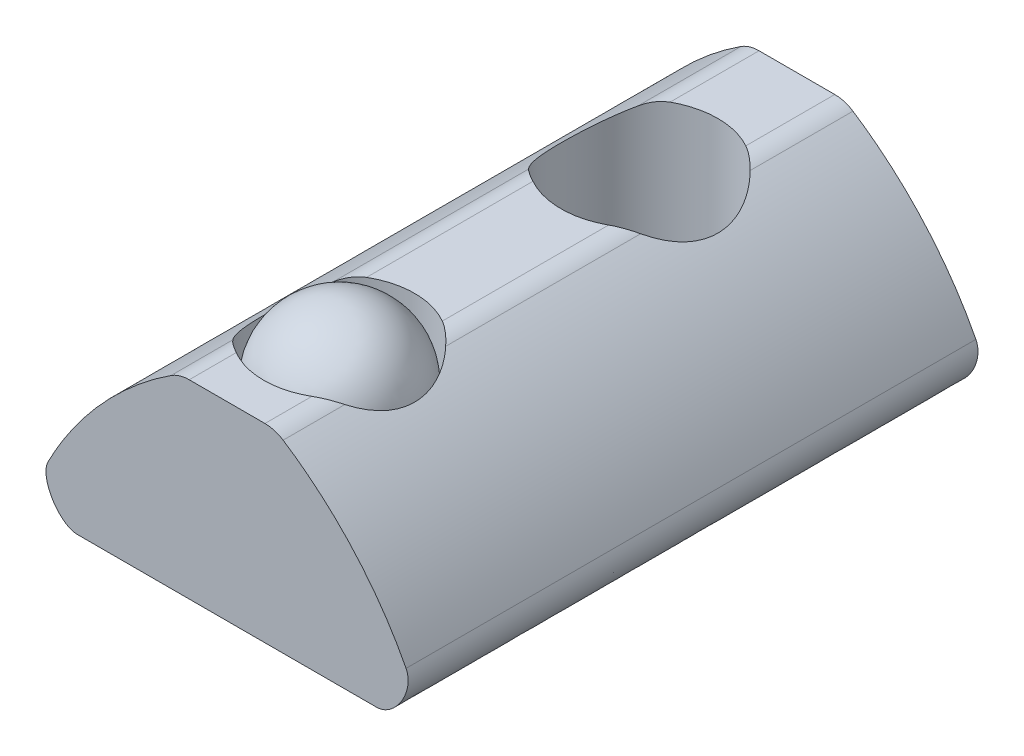
ISO-10303-21;
HEADER;
FILE_DESCRIPTION(('STEP AP214'),'2;1');
FILE_NAME('part.step','',(''),(''),'','','');
FILE_SCHEMA(('AUTOMOTIVE_DESIGN { 1 0 10303 214 1 1 1 1 }'));
ENDSEC;
DATA;
#1=APPLICATION_CONTEXT('core data for automotive mechanical design processes');
#2=APPLICATION_PROTOCOL_DEFINITION('international standard','automotive_design',2000,#1);
#3=PRODUCT_CONTEXT('',#1,'mechanical');
#4=PRODUCT('Part','Part','',(#3));
#5=PRODUCT_RELATED_PRODUCT_CATEGORY('part','',(#4));
#6=PRODUCT_DEFINITION_FORMATION('','',#4);
#7=PRODUCT_DEFINITION_CONTEXT('part definition',#1,'design');
#8=PRODUCT_DEFINITION('design','',#6,#7);
#9=PRODUCT_DEFINITION_SHAPE('','',#8);
#10=(LENGTH_UNIT() NAMED_UNIT(*) SI_UNIT(.MILLI.,.METRE.));
#11=(NAMED_UNIT(*) PLANE_ANGLE_UNIT() SI_UNIT($,.RADIAN.));
#12=(NAMED_UNIT(*) SI_UNIT($,.STERADIAN.) SOLID_ANGLE_UNIT());
#13=UNCERTAINTY_MEASURE_WITH_UNIT(LENGTH_MEASURE(1.E-05),#10,'distance_accuracy_value','');
#14=(GEOMETRIC_REPRESENTATION_CONTEXT(3) GLOBAL_UNCERTAINTY_ASSIGNED_CONTEXT((#13)) GLOBAL_UNIT_ASSIGNED_CONTEXT((#10,
#11,#12)) REPRESENTATION_CONTEXT('',''));
#15=CARTESIAN_POINT('',(0.,0.,0.));
#16=DIRECTION('',(0.,0.,1.));
#17=DIRECTION('',(1.,0.,0.));
#18=AXIS2_PLACEMENT_3D('',#15,#16,#17);
#19=CARTESIAN_POINT('',(-21.5808757413545,41.3139529714525,-20.5938046485981));
#20=DIRECTION('',(0.,1.,0.));
#21=DIRECTION('',(0.,0.,1.));
#22=AXIS2_PLACEMENT_3D('',#19,#20,#21);
#23=PLANE('',#22);
#24=CARTESIAN_POINT('',(-22.5864215322198,41.3139529714525,-17.276012221837));
#25=DIRECTION('',(0.,1.,0.));
#26=DIRECTION('',(0.,0.,1.));
#27=AXIS2_PLACEMENT_3D('',#24,#25,#26);
#28=CIRCLE('',#27,1.64999999999999);
#29=CARTESIAN_POINT('',(-21.7889618418163,41.3139529714525,-18.7205045347904));
#30=VERTEX_POINT('',#29);
#31=CARTESIAN_POINT('',(-23.3838812226233,41.3139529714525,-18.7205045347904));
#32=VERTEX_POINT('',#31);
#33=EDGE_CURVE('P0_E287',#30,#32,#28,.T.);
#34=ORIENTED_EDGE('',*,*,#33,.F.);
#35=DIRECTION('',(0.,0.,1.));
#36=VECTOR('',#35,1.);
#37=CARTESIAN_POINT('',(-21.7889618418163,41.3139529714525,-20.5938046485981));
#38=LINE('',#37,#36);
#39=CARTESIAN_POINT('',(-21.7889618418163,41.3139529714525,-20.5938046485981));
#40=VERTEX_POINT('',#39);
#41=EDGE_CURVE('P0_E188',#30,#40,#38,.F.);
#42=ORIENTED_EDGE('',*,*,#41,.T.);
#43=DIRECTION('',(-1.,0.,0.));
#44=VECTOR('',#43,1.);
#45=CARTESIAN_POINT('',(-21.5808757413545,41.3139529714525,-20.5938046485981));
#46=LINE('',#45,#44);
#47=CARTESIAN_POINT('',(-23.3838812226233,41.3139529714525,-20.5938046485981));
#48=VERTEX_POINT('',#47);
#49=EDGE_CURVE('P0_E199',#40,#48,#46,.T.);
#50=ORIENTED_EDGE('',*,*,#49,.T.);
#51=DIRECTION('',(0.,0.,1.));
#52=VECTOR('',#51,1.);
#53=CARTESIAN_POINT('',(-23.3838812226233,41.3139529714525,-20.5938046485981));
#54=LINE('',#53,#52);
#55=EDGE_CURVE('P0_E185',#48,#32,#54,.T.);
#56=ORIENTED_EDGE('',*,*,#55,.T.);
#57=EDGE_LOOP('',(#34,#42,#50,#56));
#58=FACE_BOUND('',#57,.T.);
#59=ADVANCED_FACE('P0_F34',(#58),#23,.T.);
#60=CARTESIAN_POINT('',(-23.3838812226233,40.6114210793827,-16.3891376306881));
#61=DIRECTION('',(0.,0.,1.));
#62=DIRECTION('',(1.,0.,0.));
#63=AXIS2_PLACEMENT_3D('',#60,#61,#62);
#64=CYLINDRICAL_SURFACE('',#63,0.702531892069805);
#65=CARTESIAN_POINT('',(-23.7664840677758,41.2006291260491,-16.1227765944923));
#66=CARTESIAN_POINT('',(-23.7472874967925,41.2130831298502,-16.1031363993219));
#67=CARTESIAN_POINT('',(-23.7273500697137,41.2247058447486,-16.0837154530842));
#68=CARTESIAN_POINT('',(-23.6859393424675,41.2461343895727,-16.0454181171039));
#69=CARTESIAN_POINT('',(-23.6644627952196,41.2559362116657,-16.0265430040239));
#70=CARTESIAN_POINT('',(-23.5989247036089,41.2818460594888,-15.9719822878211));
#71=CARTESIAN_POINT('',(-23.5527573231165,41.2951209366819,-15.9373273328388));
#72=CARTESIAN_POINT('',(-23.4850173192392,41.3069122033057,-15.891970456651));
#73=CARTESIAN_POINT('',(-23.4653380931175,41.3095035782089,-15.8793896751466));
#74=CARTESIAN_POINT('',(-23.4251604405094,41.3130314456689,-15.8548945873689));
#75=CARTESIAN_POINT('',(-23.4046558899514,41.3139515268956,-15.8429879911708));
#76=CARTESIAN_POINT('',(-23.3838812226233,41.3139529714525,-15.8315199088835));
#77=B_SPLINE_CURVE_WITH_KNOTS('',3,(#65,#66,#67,#68,#69,#70,#71,#72,#73,#74,#75,#76),
.UNSPECIFIED.,.F.,.F.,(4,2,2,2,2,4),(0.,0.0904080756638125,0.181012843362226,0.357529323713905,
0.427964299537039,0.499087250594516),.UNSPECIFIED.);
#78=CARTESIAN_POINT('',(-23.7664840677758,41.2006291260491,-16.1227765944923));
#79=VERTEX_POINT('',#78);
#80=CARTESIAN_POINT('',(-23.3838812226233,41.3139529714525,-15.8315199088835));
#81=VERTEX_POINT('',#80);
#82=EDGE_CURVE('P0_E154',#79,#81,#77,.T.);
#83=ORIENTED_EDGE('',*,*,#82,.F.);
#84=DIRECTION('',(0.,0.,1.));
#85=VECTOR('',#84,1.);
#86=CARTESIAN_POINT('',(-23.7664840677758,41.2006291260491,-12.0178938465854));
#87=LINE('',#86,#85);
#88=CARTESIAN_POINT('',(-23.7664840677758,41.2006291260491,-12.0178938465854));
#89=VERTEX_POINT('',#88);
#90=EDGE_CURVE('P0_E164',#89,#79,#87,.F.);
#91=ORIENTED_EDGE('',*,*,#90,.F.);
#92=CARTESIAN_POINT('',(-23.3838812226233,41.3139529714525,-12.3286715042694));
#93=CARTESIAN_POINT('',(-23.4102024315361,41.3139503408338,-12.3133860748611));
#94=CARTESIAN_POINT('',(-23.4360369470097,41.3124745623077,-12.2973581881628));
#95=CARTESIAN_POINT('',(-23.486511688802,41.306879491925,-12.2640199859217));
#96=CARTESIAN_POINT('',(-23.5111537907535,41.3027645071456,-12.2467118004143));
#97=CARTESIAN_POINT('',(-23.5820594565487,41.2871321944218,-12.1938573636354));
#98=CARTESIAN_POINT('',(-23.6264432141817,41.2722995863262,-12.1567107753813));
#99=CARTESIAN_POINT('',(-23.6852565322119,41.2463129062863,-12.1019929796837));
#100=CARTESIAN_POINT('',(-23.7021413141841,41.238007125472,-12.0855505264845));
#101=CARTESIAN_POINT('',(-23.7350232537999,41.2201912687641,-12.0520987106995));
#102=CARTESIAN_POINT('',(-23.7510111495365,41.2106711106762,-12.0350855993562));
#103=CARTESIAN_POINT('',(-23.7664840677758,41.2006291260492,-12.0178938465854));
#104=B_SPLINE_CURVE_WITH_KNOTS('',3,(#92,#93,#94,#95,#96,#97,#98,#99,#100,#101,#102,#103),
.UNSPECIFIED.,.F.,.F.,(4,2,2,2,2,4),(0.,0.0911854837038478,0.182222533754024,0.360393090692322,
0.435328148294481,0.510931679347607),.UNSPECIFIED.);
#105=CARTESIAN_POINT('',(-23.3838812226233,41.3139529714525,-12.3286715042694));
#106=VERTEX_POINT('',#105);
#107=EDGE_CURVE('P0_E237',#106,#89,#104,.T.);
#108=ORIENTED_EDGE('',*,*,#107,.F.);
#109=EDGE_CURVE('P0_E165',#81,#106,#54,.T.);
#110=ORIENTED_EDGE('',*,*,#109,.F.);
#111=EDGE_LOOP('',(#83,#91,#108,#110));
#112=FACE_BOUND('',#111,.T.);
#113=ADVANCED_FACE('P0_F162',(#112),#64,.T.);
#114=CARTESIAN_POINT('',(-21.7889618418163,40.6114210793827,-16.389118354654));
#115=DIRECTION('',(0.,0.,1.));
#116=DIRECTION('',(1.,0.,0.));
#117=AXIS2_PLACEMENT_3D('',#114,#115,#116);
#118=CYLINDRICAL_SURFACE('',#117,0.702531892069805);
#119=CARTESIAN_POINT('',(-21.7889618418163,41.3139529714525,-15.8315199088835));
#120=CARTESIAN_POINT('',(-21.7622805353445,41.3139502865238,-15.8462437864873));
#121=CARTESIAN_POINT('',(-21.7360553597341,41.3124337327941,-15.8616931379566));
#122=CARTESIAN_POINT('',(-21.684746530589,41.3066594710864,-15.8938421253453));
#123=CARTESIAN_POINT('',(-21.6596612055338,41.3024059254038,-15.9105398288057));
#124=CARTESIAN_POINT('',(-21.5874244052158,41.286204453226,-15.9615096013843));
#125=CARTESIAN_POINT('',(-21.5420926708544,41.2707879749391,-15.9973284495245));
#126=CARTESIAN_POINT('',(-21.4833514751849,41.2442539275675,-16.0487325013888));
#127=CARTESIAN_POINT('',(-21.4674193495144,41.2363012135839,-16.0632498776115));
#128=CARTESIAN_POINT('',(-21.4362938333725,41.2192795352941,-16.0927258259393));
#129=CARTESIAN_POINT('',(-21.4211078498032,41.2102016802373,-16.1076870948055));
#130=CARTESIAN_POINT('',(-21.4063561005426,41.20062724544,-16.1227795579914));
#131=B_SPLINE_CURVE_WITH_KNOTS('',3,(#119,#120,#121,#122,#123,#124,#125,#126,#127,#128,#129,
#130),.UNSPECIFIED.,.F.,.F.,(4,2,2,2,2,4),(0.,0.0912923386917037,0.182446171133288,
0.360702919821942,0.429602237236524,0.499085598375937),.UNSPECIFIED.);
#132=CARTESIAN_POINT('',(-21.7889618418163,41.3139529714525,-15.8315199088835));
#133=VERTEX_POINT('',#132);
#134=CARTESIAN_POINT('',(-21.4063561005426,41.2006272454397,-16.1227795579913));
#135=VERTEX_POINT('',#134);
#136=EDGE_CURVE('P0_E286',#133,#135,#131,.T.);
#137=ORIENTED_EDGE('',*,*,#136,.F.);
#138=CARTESIAN_POINT('',(-21.7889618418163,41.3139529714525,-12.3286715010079));
#139=VERTEX_POINT('',#138);
#140=EDGE_CURVE('P0_E189',#139,#133,#38,.F.);
#141=ORIENTED_EDGE('',*,*,#140,.F.);
#142=CARTESIAN_POINT('',(-21.4063561005426,41.2006272454397,-12.017890621919));
#143=CARTESIAN_POINT('',(-21.4248257692933,41.212610940333,-12.0384121752666));
#144=CARTESIAN_POINT('',(-21.4440332765686,41.2238574764844,-12.0586821204358));
#145=CARTESIAN_POINT('',(-21.4839868187082,41.244709203805,-12.0986322413205));
#146=CARTESIAN_POINT('',(-21.5047360171248,41.2543108784525,-12.1183110810936));
#147=CARTESIAN_POINT('',(-21.5681908971989,41.2798904365432,-12.1752343887952));
#148=CARTESIAN_POINT('',(-21.6130311064621,41.2932615794755,-12.211408343338));
#149=CARTESIAN_POINT('',(-21.6807712002384,41.3058860565277,-12.2600737453666));
#150=CARTESIAN_POINT('',(-21.7017320195924,41.3088468102311,-12.2743854659872));
#151=CARTESIAN_POINT('',(-21.7446622421523,41.3128892995619,-12.302206272617));
#152=CARTESIAN_POINT('',(-21.7666398072953,41.3139513764214,-12.3157055783771));
#153=CARTESIAN_POINT('',(-21.7889618418163,41.3139529714525,-12.3286715010079));
#154=B_SPLINE_CURVE_WITH_KNOTS('',3,(#142,#143,#144,#145,#146,#147,#148,#149,#150,#151,#152,
#153),.UNSPECIFIED.,.F.,.F.,(4,2,2,2,2,4),(0.,0.0902416489132471,0.180673879395116,
0.357006268703466,0.433580685959851,0.510943455610445),.UNSPECIFIED.);
#155=CARTESIAN_POINT('',(-21.4063561005426,41.2006272454397,-12.017890621919));
#156=VERTEX_POINT('',#155);
#157=EDGE_CURVE('P0_E242',#156,#139,#154,.T.);
#158=ORIENTED_EDGE('',*,*,#157,.F.);
#159=DIRECTION('',(0.,0.,1.));
#160=VECTOR('',#159,1.);
#161=CARTESIAN_POINT('',(-21.4063561005426,41.2006272454397,-20.5938046485981));
#162=LINE('',#161,#160);
#163=EDGE_CURVE('P0_E216',#135,#156,#162,.T.);
#164=ORIENTED_EDGE('',*,*,#163,.F.);
#165=EDGE_LOOP('',(#137,#141,#158,#164));
#166=FACE_BOUND('',#165,.T.);
#167=ADVANCED_FACE('P0_F277',(#166),#118,.T.);
#168=EDGE_CURVE('P0_E166',#81,#133,#28,.T.);
#169=ORIENTED_EDGE('',*,*,#168,.F.);
#170=ORIENTED_EDGE('',*,*,#109,.T.);
#171=CARTESIAN_POINT('',(-22.5864215350269,41.3139529714525,-10.9560046485981));
#172=DIRECTION('',(0.,1.,0.));
#173=DIRECTION('',(0.,0.,1.));
#174=AXIS2_PLACEMENT_3D('',#171,#172,#173);
#175=CIRCLE('',#174,1.58750000000004);
#176=EDGE_CURVE('P0_E298',#139,#106,#175,.T.);
#177=ORIENTED_EDGE('',*,*,#176,.F.);
#178=ORIENTED_EDGE('',*,*,#140,.T.);
#179=EDGE_LOOP('',(#169,#170,#177,#178));
#180=FACE_BOUND('',#179,.T.);
#181=ADVANCED_FACE('P0_F303',(#180),#23,.T.);
#182=CARTESIAN_POINT('',(-18.8175588370269,38.3334356724525,-20.5938046485981));
#183=CARTESIAN_POINT('',(-19.4052347819,39.4791271937958,-20.5938046485981));
#184=CARTESIAN_POINT('',(-20.3263478267443,40.4993152260092,-20.5938046485981));
#185=CARTESIAN_POINT('',(-21.4062809648588,41.2005784554818,-20.5938046485981));
#186=CARTESIAN_POINT('',(-21.4644792236907,41.2383699608054,-20.5938046485981));
#187=CARTESIAN_POINT('',(-21.5226774825226,41.276161466129,-20.5938046485981));
#188=CARTESIAN_POINT('',(-21.5808757413545,41.3139529714525,-20.5938046485981));
#189=B_SPLINE_CURVE_WITH_KNOTS('',3,(#182,#183,#184,#185,#186,#187,#188),.UNSPECIFIED.,.F.,.F.,
(4,3,4),(0.,1.,1.05389061301843),.UNSPECIFIED.);
#190=DIRECTION('',(0.,0.,1.));
#191=VECTOR('',#190,1.);
#192=SURFACE_OF_LINEAR_EXTRUSION('',#189,#191);
#193=CARTESIAN_POINT('',(-21.4257953478429,41.21325027631,-16.1032177555562));
#194=CARTESIAN_POINT('',(-21.3952942138539,41.1935593379978,-16.1334065838381));
#195=CARTESIAN_POINT('',(-21.3658564365602,41.1742332639482,-16.1648907160736));
#196=CARTESIAN_POINT('',(-21.3092624420051,41.1365288335373,-16.2304293210132));
#197=CARTESIAN_POINT('',(-21.2821081762935,41.1181512928955,-16.2644859459952));
#198=CARTESIAN_POINT('',(-21.2039108039459,41.0644976240717,-16.3710411209561));
#199=CARTESIAN_POINT('',(-21.1566908555995,41.0310647227459,-16.447378493637));
#200=CARTESIAN_POINT('',(-21.0742248170013,40.9715344966721,-16.6096331836701));
#201=CARTESIAN_POINT('',(-21.0390458512176,40.94547843019,-16.6956007694512));
#202=CARTESIAN_POINT('',(-20.9972939114405,40.9141931779459,-16.8295171395935));
#203=CARTESIAN_POINT('',(-20.9852236540344,40.9050732912612,-16.87490386341));
#204=CARTESIAN_POINT('',(-20.9649310536069,40.8896716241845,-16.9669940037492));
#205=CARTESIAN_POINT('',(-20.9567079282501,40.8833892667746,-17.0136971505201));
#206=CARTESIAN_POINT('',(-20.9398780371828,40.8705076990586,-17.1417446247486));
#207=CARTESIAN_POINT('',(-20.9352052648301,40.8668970115106,-17.2239690614497));
#208=CARTESIAN_POINT('',(-20.9381834043153,40.8691874855834,-17.3880612199149));
#209=CARTESIAN_POINT('',(-20.9458393808603,40.8750925563225,-17.4699287812183));
#210=CARTESIAN_POINT('',(-20.9715565461096,40.8947176417636,-17.622581929546));
#211=CARTESIAN_POINT('',(-20.9885217296286,40.907612994863,-17.6936661363075));
#212=CARTESIAN_POINT('',(-21.0311499368627,40.939568560786,-17.8317596310933));
#213=CARTESIAN_POINT('',(-21.0568191427328,40.9586331549596,-17.8987659827542));
#214=CARTESIAN_POINT('',(-21.102425783483,40.9919030863313,-17.9983417003339));
#215=CARTESIAN_POINT('',(-21.1196906036327,41.0043963392188,-18.0327583831911));
#216=CARTESIAN_POINT('',(-21.1563298321172,41.0306341533476,-18.0999047477218));
#217=CARTESIAN_POINT('',(-21.1757023790411,41.0443776087588,-18.1326358809217));
#218=CARTESIAN_POINT('',(-21.2367842820486,41.0872147138995,-18.2282158430181));
#219=CARTESIAN_POINT('',(-21.2814763730453,41.1179287669663,-18.2884910372611));
#220=CARTESIAN_POINT('',(-21.344910955905,41.160298384633,-18.3630804203273));
#221=CARTESIAN_POINT('',(-21.3606444706125,41.1707186625857,-18.3807881303334));
#222=CARTESIAN_POINT('',(-21.392744969665,41.1918024752639,-18.4153940989997));
#223=CARTESIAN_POINT('',(-21.4091106862677,41.2024655071841,-18.4322938395595));
#224=CARTESIAN_POINT('',(-21.4257953478429,41.21325027631,-18.4488066881177));
#225=B_SPLINE_CURVE_WITH_KNOTS('',3,(#193,#194,#195,#196,#197,#198,#199,#200,#201,#202,#203,
#204,#205,#206,#207,#208,#209,#210,#211,#212,#213,#214,#215,#216,#217,#218,#219,#220,#221,#222,
#223,#224),.UNSPECIFIED.,.F.,.F.,(4,2,2,2,2,2,2,2,2,2,2,2,2,2,2,4),(0.,0.141591357847835,
0.283302519052812,0.569281875669726,0.856830452521885,1.00012900243645,1.1433983991282,
1.38916117978344,1.63502494668526,1.85673694474008,2.07860674788563,2.19994984663676,
2.321186639592,2.56352355351275,2.64114735935535,2.71862285696379),.UNSPECIFIED.);
#226=CARTESIAN_POINT('',(-21.4063561005426,41.2006272454397,-18.4292448856826));
#227=VERTEX_POINT('',#226);
#228=EDGE_CURVE('P0_E292',#135,#227,#225,.T.);
#229=ORIENTED_EDGE('',*,*,#228,.F.);
#230=ORIENTED_EDGE('',*,*,#163,.T.);
#231=CARTESIAN_POINT('',(-21.5808757413545,41.3139529714525,-9.72757723648613));
#232=CARTESIAN_POINT('',(-21.5644830866892,41.303306022472,-9.74099536393331));
#233=CARTESIAN_POINT('',(-21.5483036541258,41.2928009021137,-9.75478748552274));
#234=CARTESIAN_POINT('',(-21.5164067030325,41.2720906089797,-9.78311114280174));
#235=CARTESIAN_POINT('',(-21.5006891854218,41.2618854368008,-9.79764267996244));
#236=CARTESIAN_POINT('',(-21.4697434899956,41.2417861056609,-9.82744435051691));
#237=CARTESIAN_POINT('',(-21.4545155730386,41.2318921125547,-9.84271486712913));
#238=CARTESIAN_POINT('',(-21.4245854490583,41.2124724907902,-9.87398752213828));
#239=CARTESIAN_POINT('',(-21.4098832430117,41.2029468628163,-9.88998966189435));
#240=CARTESIAN_POINT('',(-21.380934602278,41.1840617575548,-9.92283386848665));
#241=CARTESIAN_POINT('',(-21.3666941500586,41.1747048727191,-9.93968270275896));
#242=CARTESIAN_POINT('',(-21.3388586119873,41.1562714445385,-9.97405145411295));
#243=CARTESIAN_POINT('',(-21.3252635266524,41.1471949014183,-9.99157137173231));
#244=CARTESIAN_POINT('',(-21.285490117734,41.1204518703236,-10.0451202786198));
#245=CARTESIAN_POINT('',(-21.2603148000099,41.1032661923394,-10.08214842681));
#246=CARTESIAN_POINT('',(-21.2128112804082,41.0704382722193,-10.1588871380132));
#247=CARTESIAN_POINT('',(-21.1904958080726,41.0548029964634,-10.1986085673098));
#248=CARTESIAN_POINT('',(-21.1491192735849,41.0255093608755,-10.2804163734589));
#249=CARTESIAN_POINT('',(-21.1300582647521,41.0118510334332,-10.3225027890427));
#250=CARTESIAN_POINT('',(-21.0955655440615,40.9869259968549,-10.4086069847864));
#251=CARTESIAN_POINT('',(-21.0801187107844,40.9756493430079,-10.452615769255));
#252=CARTESIAN_POINT('',(-21.0530366929838,40.9557527742257,-10.5423745021613));
#253=CARTESIAN_POINT('',(-21.0414023449105,40.947133442325,-10.5881248302354));
#254=CARTESIAN_POINT('',(-21.0151987371638,40.9276458745967,-10.7149193348172));
#255=CARTESIAN_POINT('',(-21.0046930076715,40.9197336467918,-10.7973340552783));
#256=CARTESIAN_POINT('',(-20.9967691675979,40.9137749761179,-10.9631225464517));
#257=CARTESIAN_POINT('',(-20.9993491699169,40.9157271107042,-11.0464961771489));
#258=CARTESIAN_POINT('',(-21.0161599611085,40.9283331274294,-11.2001509947761));
#259=CARTESIAN_POINT('',(-21.0288131538642,40.937808297569,-11.2707114724371));
#260=CARTESIAN_POINT('',(-21.0630858372356,40.963172586425,-11.4083757754405));
#261=CARTESIAN_POINT('',(-21.0847054087688,40.979061763025,-11.4754795695817));
#262=CARTESIAN_POINT('',(-21.1373325829489,41.0171233456148,-11.6084462336351));
#263=CARTESIAN_POINT('',(-21.1687802618226,41.0395862294086,-11.6740510065405));
#264=CARTESIAN_POINT('',(-21.22172221835,41.0766077628512,-11.7678215858293));
#265=CARTESIAN_POINT('',(-21.2403485768925,41.0895145256205,-11.798328336085));
#266=CARTESIAN_POINT('',(-21.2794039622641,41.1162770130886,-11.8577381949543));
#267=CARTESIAN_POINT('',(-21.2998329580339,41.1301327214362,-11.8866413311841));
#268=CARTESIAN_POINT('',(-21.3403522381466,41.1572866954137,-11.9401211918505));
#269=CARTESIAN_POINT('',(-21.360292237323,41.1705139879124,-11.964848695948));
#270=CARTESIAN_POINT('',(-21.4014632053641,41.1974953495034,-12.0129005300507));
#271=CARTESIAN_POINT('',(-21.4226940842107,41.2112493818393,-12.0362249576729));
#272=CARTESIAN_POINT('',(-21.4661795837422,41.239461213265,-12.0812567988321));
#273=CARTESIAN_POINT('',(-21.4884303005319,41.2539163392491,-12.1029696613556));
#274=CARTESIAN_POINT('',(-21.5339291712534,41.2834742855229,-12.1448575425966));
#275=CARTESIAN_POINT('',(-21.5571773515715,41.298577122947,-12.1650325205924));
#276=CARTESIAN_POINT('',(-21.5808757413545,41.3139529714525,-12.18443206071));
#277=B_SPLINE_CURVE_WITH_KNOTS('',3,(#231,#232,#233,#234,#235,#236,#237,#238,#239,#240,#241,
#242,#243,#244,#245,#246,#247,#248,#249,#250,#251,#252,#253,#254,#255,#256,#257,#258,#259,#260,
#261,#262,#263,#264,#265,#266,#267,#268,#269,#270,#271,#272,#273,#274,#275,#276),.UNSPECIFIED.,
.F.,.F.,(4,2,2,2,2,2,2,2,2,2,2,2,2,2,2,2,2,2,2,2,2,2,4),(0.,0.0711238013806847,
0.142247744274561,0.2134089742079,0.284570336341879,0.356438991948616,0.428307705139919,
0.572001606577534,0.7163143979118,0.860629553350972,1.004329654578,1.14806126219103,
1.3967790278061,1.6454609267302,1.86142292985174,2.07738688197397,2.30489566286476,
2.41883338336347,2.53276914110222,2.63594258480276,2.73910884204808,2.84190867905558,
2.94471123715669),.UNSPECIFIED.);
#278=CARTESIAN_POINT('',(-21.4063561005426,41.2006272454397,-9.89411867527714));
#279=VERTEX_POINT('',#278);
#280=EDGE_CURVE('P0_E221',#279,#156,#277,.T.);
#281=ORIENTED_EDGE('',*,*,#280,.F.);
#282=DIRECTION('',(0.,0.,1.));
#283=VECTOR('',#282,1.);
#284=CARTESIAN_POINT('',(-21.4063561005426,41.2006272454397,-9.89411867527714));
#285=LINE('',#284,#283);
#286=CARTESIAN_POINT('',(-21.4063561005427,41.2006272454397,-8.59380464859805));
#287=VERTEX_POINT('',#286);
#288=EDGE_CURVE('P0_E215',#279,#287,#285,.T.);
#289=ORIENTED_EDGE('',*,*,#288,.T.);
#290=CARTESIAN_POINT('',(-18.8175588370269,38.3334356724525,-8.59380464859805));
#291=CARTESIAN_POINT('',(-19.4052347819,39.4791271937958,-8.59380464859805));
#292=CARTESIAN_POINT('',(-20.3263478267443,40.4993152260092,-8.59380464859805));
#293=CARTESIAN_POINT('',(-21.4062809648588,41.2005784554818,-8.59380464859805));
#294=CARTESIAN_POINT('',(-21.4644792236907,41.2383699608054,-8.59380464859805));
#295=CARTESIAN_POINT('',(-21.5226774825226,41.276161466129,-8.59380464859805));
#296=CARTESIAN_POINT('',(-21.5808757413545,41.3139529714525,-8.59380464859805));
#297=B_SPLINE_CURVE_WITH_KNOTS('',3,(#290,#291,#292,#293,#294,#295,#296),.UNSPECIFIED.,.F.,.F.,
(4,3,4),(0.,1.,1.05389061301843),.UNSPECIFIED.);
#298=CARTESIAN_POINT('',(-18.8175588370269,38.3334356724525,-8.59380464859805));
#299=VERTEX_POINT('',#298);
#300=EDGE_CURVE('P0_E351',#299,#287,#297,.T.);
#301=ORIENTED_EDGE('',*,*,#300,.F.);
#302=DIRECTION('',(0.,0.,1.));
#303=VECTOR('',#302,1.);
#304=CARTESIAN_POINT('',(-18.8175588370269,38.3334356724525,-20.5938046485981));
#305=LINE('',#304,#303);
#306=CARTESIAN_POINT('',(-18.8175588370269,38.3334356724525,-20.5938046485981));
#307=VERTEX_POINT('',#306);
#308=EDGE_CURVE('P0_E209',#307,#299,#305,.T.);
#309=ORIENTED_EDGE('',*,*,#308,.F.);
#310=CARTESIAN_POINT('',(-21.4063561005427,41.2006272454397,-20.5938046485981));
#311=VERTEX_POINT('',#310);
#312=EDGE_CURVE('P0_E197',#307,#311,#189,.T.);
#313=ORIENTED_EDGE('',*,*,#312,.T.);
#314=EDGE_CURVE('P0_E207',#311,#227,#162,.T.);
#315=ORIENTED_EDGE('',*,*,#314,.T.);
#316=EDGE_LOOP('',(#229,#230,#281,#289,#301,#309,#313,#315));
#317=FACE_BOUND('',#316,.T.);
#318=ADVANCED_FACE('P0_F206',(#317),#192,.T.);
#319=CARTESIAN_POINT('',(-19.4403997510269,37.3139529714525,-20.5938046485981));
#320=CARTESIAN_POINT('',(-19.0421709243443,37.3139529714525,-20.5938046485981));
#321=CARTESIAN_POINT('',(-18.6358056642146,37.9791025212061,-20.5938046485981));
#322=CARTESIAN_POINT('',(-18.8175588370269,38.3334356724525,-20.5938046485981));
#323=B_SPLINE_CURVE_WITH_KNOTS('',3,(#319,#320,#321,#322),.UNSPECIFIED.,.F.,.F.,(4,4),(0.,1.),.UNSPECIFIED.);
#324=DIRECTION('',(0.,0.,1.));
#325=VECTOR('',#324,1.);
#326=SURFACE_OF_LINEAR_EXTRUSION('',#323,#325);
#327=CARTESIAN_POINT('',(-19.4403997510269,37.3139529714525,-8.59380464859805));
#328=CARTESIAN_POINT('',(-19.0421709243443,37.3139529714525,-8.59380464859805));
#329=CARTESIAN_POINT('',(-18.6358056642146,37.9791025212061,-8.59380464859805));
#330=CARTESIAN_POINT('',(-18.8175588370269,38.3334356724525,-8.59380464859805));
#331=B_SPLINE_CURVE_WITH_KNOTS('',3,(#327,#328,#329,#330),.UNSPECIFIED.,.F.,.F.,(4,4),(0.,1.),.UNSPECIFIED.);
#332=CARTESIAN_POINT('',(-19.4403997510269,37.3139529714525,-8.59380464859805));
#333=VERTEX_POINT('',#332);
#334=EDGE_CURVE('P0_E210',#333,#299,#331,.T.);
#335=ORIENTED_EDGE('',*,*,#334,.F.);
#336=DIRECTION('',(0.,0.,1.));
#337=VECTOR('',#336,1.);
#338=CARTESIAN_POINT('',(-19.4403997510269,37.3139529714525,-20.5938046485981));
#339=LINE('',#338,#337);
#340=CARTESIAN_POINT('',(-19.4403997510269,37.3139529714525,-20.5938046485981));
#341=VERTEX_POINT('',#340);
#342=EDGE_CURVE('P0_E391',#341,#333,#339,.T.);
#343=ORIENTED_EDGE('',*,*,#342,.F.);
#344=EDGE_CURVE('P0_E344',#341,#307,#323,.T.);
#345=ORIENTED_EDGE('',*,*,#344,.T.);
#346=ORIENTED_EDGE('',*,*,#308,.T.);
#347=EDGE_LOOP('',(#335,#343,#345,#346));
#348=FACE_BOUND('',#347,.T.);
#349=ADVANCED_FACE('P0_F302',(#348),#326,.T.);
#350=CARTESIAN_POINT('',(-25.7324433201869,37.3139529714525,-20.5938046485981));
#351=DIRECTION('',(0.,-1.,0.));
#352=DIRECTION('',(0.,0.,-1.));
#353=AXIS2_PLACEMENT_3D('',#350,#351,#352);
#354=PLANE('',#353);
#355=CARTESIAN_POINT('',(-22.5864215322198,37.3139529714525,-17.276012221837));
#356=DIRECTION('',(0.,-1.,0.));
#357=DIRECTION('',(0.,0.,-1.));
#358=AXIS2_PLACEMENT_3D('',#355,#356,#357);
#359=CIRCLE('',#358,1.64999999999999);
#360=CARTESIAN_POINT('',(-22.5864215322198,37.3139529714525,-18.926012221837));
#361=VERTEX_POINT('',#360);
#362=EDGE_CURVE('P0_E543',#361,#361,#359,.T.);
#363=ORIENTED_EDGE('',*,*,#362,.F.);
#364=EDGE_LOOP('',(#363));
#365=FACE_BOUND('',#364,.T.);
#366=DIRECTION('',(1.,0.,0.));
#367=VECTOR('',#366,1.);
#368=CARTESIAN_POINT('',(-25.7324433201869,37.3139529714525,-8.59380464859805));
#369=LINE('',#368,#367);
#370=CARTESIAN_POINT('',(-25.7324433201869,37.3139529714525,-8.59380464859805));
#371=VERTEX_POINT('',#370);
#372=EDGE_CURVE('P0_E377',#371,#333,#369,.T.);
#373=ORIENTED_EDGE('',*,*,#372,.F.);
#374=DIRECTION('',(0.,0.,1.));
#375=VECTOR('',#374,1.);
#376=CARTESIAN_POINT('',(-25.7324433201869,37.3139529714525,-20.5938046485981));
#377=LINE('',#376,#375);
#378=CARTESIAN_POINT('',(-25.7324433201869,37.3139529714525,-20.5938046485981));
#379=VERTEX_POINT('',#378);
#380=EDGE_CURVE('P0_E393',#379,#371,#377,.T.);
#381=ORIENTED_EDGE('',*,*,#380,.F.);
#382=DIRECTION('',(1.,0.,0.));
#383=VECTOR('',#382,1.);
#384=CARTESIAN_POINT('',(-25.7324433201869,37.3139529714525,-20.5938046485981));
#385=LINE('',#384,#383);
#386=EDGE_CURVE('P0_E350',#379,#341,#385,.T.);
#387=ORIENTED_EDGE('',*,*,#386,.T.);
#388=ORIENTED_EDGE('',*,*,#342,.T.);
#389=EDGE_LOOP('',(#373,#381,#387,#388));
#390=FACE_BOUND('',#389,.T.);
#391=ADVANCED_FACE('P0_F334',(#365,#390),#354,.T.);
#392=CARTESIAN_POINT('',(-26.3552842341869,38.3334356724525,-20.5938046485981));
#393=CARTESIAN_POINT('',(-26.5370374069992,37.9791025212061,-20.5938046485981));
#394=CARTESIAN_POINT('',(-26.1306721468694,37.3139529714525,-20.5938046485981));
#395=CARTESIAN_POINT('',(-25.7324433201869,37.3139529714525,-20.5938046485981));
#396=B_SPLINE_CURVE_WITH_KNOTS('',3,(#392,#393,#394,#395),.UNSPECIFIED.,.F.,.F.,(4,4),(0.,1.),.UNSPECIFIED.);
#397=DIRECTION('',(0.,0.,1.));
#398=VECTOR('',#397,1.);
#399=SURFACE_OF_LINEAR_EXTRUSION('',#396,#398);
#400=CARTESIAN_POINT('',(-26.3552842341869,38.3334356724525,-8.59380464859805));
#401=CARTESIAN_POINT('',(-26.5370374069992,37.9791025212061,-8.59380464859805));
#402=CARTESIAN_POINT('',(-26.1306721468694,37.3139529714525,-8.59380464859805));
#403=CARTESIAN_POINT('',(-25.7324433201869,37.3139529714525,-8.59380464859805));
#404=B_SPLINE_CURVE_WITH_KNOTS('',3,(#400,#401,#402,#403),.UNSPECIFIED.,.F.,.F.,(4,4),(0.,1.),.UNSPECIFIED.);
#405=CARTESIAN_POINT('',(-26.3552842341869,38.3334356724525,-8.59380464859805));
#406=VERTEX_POINT('',#405);
#407=EDGE_CURVE('P0_E369',#406,#371,#404,.T.);
#408=ORIENTED_EDGE('',*,*,#407,.F.);
#409=DIRECTION('',(0.,0.,1.));
#410=VECTOR('',#409,1.);
#411=CARTESIAN_POINT('',(-26.3552842341869,38.3334356724525,-20.5938046485981));
#412=LINE('',#411,#410);
#413=CARTESIAN_POINT('',(-26.3552842341869,38.3334356724525,-20.5938046485981));
#414=VERTEX_POINT('',#413);
#415=EDGE_CURVE('P0_E349',#414,#406,#412,.T.);
#416=ORIENTED_EDGE('',*,*,#415,.F.);
#417=EDGE_CURVE('P0_E319',#414,#379,#396,.T.);
#418=ORIENTED_EDGE('',*,*,#417,.T.);
#419=ORIENTED_EDGE('',*,*,#380,.T.);
#420=EDGE_LOOP('',(#408,#416,#418,#419));
#421=FACE_BOUND('',#420,.T.);
#422=ADVANCED_FACE('P0_F330',(#421),#399,.T.);
#423=CARTESIAN_POINT('',(-23.5919202296312,41.3139529714525,-20.5938046485981));
#424=CARTESIAN_POINT('',(-23.6498752948164,41.2763295581192,-20.5938046485981));
#425=CARTESIAN_POINT('',(-23.7078303600016,41.2387061447859,-20.5938046485981));
#426=CARTESIAN_POINT('',(-23.7657854251869,41.2010827314525,-20.5938046485981));
#427=CARTESIAN_POINT('',(-24.8460465772831,40.499796110458,-20.5938046485981));
#428=CARTESIAN_POINT('',(-25.7674674095322,39.4794018430691,-20.5938046485981));
#429=CARTESIAN_POINT('',(-26.3552842341869,38.3334356724525,-20.5938046485981));
#430=B_SPLINE_CURVE_WITH_KNOTS('',3,(#423,#424,#425,#426,#427,#428,#429),.UNSPECIFIED.,.F.,.F.,
(4,3,4),(-0.0536491246332066,0.,1.),.UNSPECIFIED.);
#431=DIRECTION('',(0.,0.,1.));
#432=VECTOR('',#431,1.);
#433=SURFACE_OF_LINEAR_EXTRUSION('',#430,#432);
#434=CARTESIAN_POINT('',(-23.7470435811755,41.213249608353,-18.4488107806176));
#435=CARTESIAN_POINT('',(-23.7775498510755,41.1935572657786,-18.418617031602));
#436=CARTESIAN_POINT('',(-23.8069921182043,41.1742288351558,-18.3871279348289));
#437=CARTESIAN_POINT('',(-23.8635893715713,41.1365222007629,-18.3215844240698));
#438=CARTESIAN_POINT('',(-23.8907427909468,41.1181446512025,-18.2875282825072));
#439=CARTESIAN_POINT('',(-23.9689423435603,41.0644881581082,-18.1809684660969));
#440=CARTESIAN_POINT('',(-24.016164681062,41.0310531602041,-18.1046251287197));
#441=CARTESIAN_POINT('',(-24.0986338512917,40.9715197920026,-17.9423568313047));
#442=CARTESIAN_POINT('',(-24.13381346792,40.9454627366854,-17.8563815360603));
#443=CARTESIAN_POINT('',(-24.1755646547693,40.9141775349976,-17.7224525833465));
#444=CARTESIAN_POINT('',(-24.1876344212582,40.9050578825803,-17.6770611723558));
#445=CARTESIAN_POINT('',(-24.2079249419786,40.8896575728976,-17.5849630298738));
#446=CARTESIAN_POINT('',(-24.216146596651,40.8833762514871,-17.5382566088036));
#447=CARTESIAN_POINT('',(-24.2329709069847,40.8704987906095,-17.4102068624625));
#448=CARTESIAN_POINT('',(-24.2376399741166,40.8668909257995,-17.3279838073562));
#449=CARTESIAN_POINT('',(-24.2346549432492,40.8691867311436,-17.1638951676484));
#450=CARTESIAN_POINT('',(-24.2269957739724,40.8750943155229,-17.0820297440521));
#451=CARTESIAN_POINT('',(-24.2012732434503,40.8947235678802,-16.9293808702927));
#452=CARTESIAN_POINT('',(-24.18430575613,40.9076206811288,-16.8582987538717));
#453=CARTESIAN_POINT('',(-24.1416727141604,40.9395801227035,-16.7202077833595));
#454=CARTESIAN_POINT('',(-24.1160007771404,40.9586469744022,-16.6532019607735));
#455=CARTESIAN_POINT('',(-24.0703900119277,40.9919196272031,-16.5536264799181));
#456=CARTESIAN_POINT('',(-24.0531232585263,41.0044140434479,-16.5192090269616));
#457=CARTESIAN_POINT('',(-24.0164799752105,41.0306555802037,-16.4520622657112));
#458=CARTESIAN_POINT('',(-23.997105485938,41.0444014869951,-16.4193313690146));
#459=CARTESIAN_POINT('',(-23.9360252953501,41.0872330429412,-16.3237604281676));
#460=CARTESIAN_POINT('',(-23.891345758943,41.1179251944811,-16.2635052752282));
#461=CARTESIAN_POINT('',(-23.8125356725616,41.170591862615,-16.1708424221146));
#462=CARTESIAN_POINT('',(-23.780406663696,41.1917216349181,-16.1362249690831));
#463=CARTESIAN_POINT('',(-23.7470435811755,41.213249608353,-16.1032136630564));
#464=B_SPLINE_CURVE_WITH_KNOTS('',3,(#434,#435,#436,#437,#438,#439,#440,#441,#442,#443,#444,
#445,#446,#447,#448,#449,#450,#451,#452,#453,#454,#455,#456,#457,#458,#459,#460,#461,#462,#463),
.UNSPECIFIED.,.F.,.F.,(4,2,2,2,2,2,2,2,2,2,2,2,2,2,4),(0.,0.141612523286114,0.283321215164432,
0.569320218980569,0.856890439880609,1.00020175129379,1.14347951171189,1.38923724828624,
1.63509610429212,1.85680495081526,2.07867671391086,2.20002714293924,2.32126111274346,
2.56360253375653,2.71860351303532),.UNSPECIFIED.);
#465=CARTESIAN_POINT('',(-23.7664840677758,41.2006291260491,-18.4292478491817));
#466=VERTEX_POINT('',#465);
#467=EDGE_CURVE('P0_E11',#466,#79,#464,.T.);
#468=ORIENTED_EDGE('',*,*,#467,.F.);
#469=CARTESIAN_POINT('',(-23.7664840677758,41.2006291260491,-20.5938046485981));
#470=VERTEX_POINT('',#469);
#471=EDGE_CURVE('P0_E173',#466,#470,#87,.F.);
#472=ORIENTED_EDGE('',*,*,#471,.T.);
#473=EDGE_CURVE('P0_E314',#470,#414,#430,.T.);
#474=ORIENTED_EDGE('',*,*,#473,.T.);
#475=ORIENTED_EDGE('',*,*,#415,.T.);
#476=CARTESIAN_POINT('',(-23.5919202296312,41.3139529714525,-8.59380464859805));
#477=CARTESIAN_POINT('',(-23.6498752948164,41.2763295581192,-8.59380464859805));
#478=CARTESIAN_POINT('',(-23.7078303600016,41.2387061447859,-8.59380464859805));
#479=CARTESIAN_POINT('',(-23.7657854251869,41.2010827314525,-8.59380464859805));
#480=CARTESIAN_POINT('',(-24.8460465772831,40.499796110458,-8.59380464859805));
#481=CARTESIAN_POINT('',(-25.7674674095322,39.4794018430691,-8.59380464859805));
#482=CARTESIAN_POINT('',(-26.3552842341869,38.3334356724525,-8.59380464859805));
#483=B_SPLINE_CURVE_WITH_KNOTS('',3,(#476,#477,#478,#479,#480,#481,#482),.UNSPECIFIED.,.F.,.F.,
(4,3,4),(-0.0536491246332066,0.,1.),.UNSPECIFIED.);
#484=CARTESIAN_POINT('',(-23.7664840677758,41.2006291260491,-8.59380464859805));
#485=VERTEX_POINT('',#484);
#486=EDGE_CURVE('P0_E365',#485,#406,#483,.T.);
#487=ORIENTED_EDGE('',*,*,#486,.F.);
#488=DIRECTION('',(0.,0.,1.));
#489=VECTOR('',#488,1.);
#490=CARTESIAN_POINT('',(-23.7664840677758,41.2006291260491,-8.59380464859805));
#491=LINE('',#490,#489);
#492=CARTESIAN_POINT('',(-23.7664840677758,41.2006291260491,-9.89411545061068));
#493=VERTEX_POINT('',#492);
#494=EDGE_CURVE('P0_E172',#485,#493,#491,.F.);
#495=ORIENTED_EDGE('',*,*,#494,.T.);
#496=CARTESIAN_POINT('',(-23.5919202296312,41.3139529714525,-12.1844706127782));
#497=CARTESIAN_POINT('',(-23.6083153640549,41.3033073138544,-12.1710515050749));
#498=CARTESIAN_POINT('',(-23.6244972034031,41.2928034588786,-12.1572583357653));
#499=CARTESIAN_POINT('',(-23.6563988068776,41.2720957200694,-12.128932463447));
#500=CARTESIAN_POINT('',(-23.6721185708982,41.2618918363046,-12.114399760269));
#501=CARTESIAN_POINT('',(-23.7030686856874,41.2417951157216,-12.0845955632203));
#502=CARTESIAN_POINT('',(-23.7182987741248,41.2319024456876,-12.0693236839791));
#503=CARTESIAN_POINT('',(-23.7482330117443,41.2124852388648,-12.0380482432937));
#504=CARTESIAN_POINT('',(-23.7629371595714,41.2029607030246,-12.0220446799647));
#505=CARTESIAN_POINT('',(-23.7918889312178,41.1840751791647,-11.9891982736842));
#506=CARTESIAN_POINT('',(-23.8061305618669,41.1747167590463,-11.9723486677644));
#507=CARTESIAN_POINT('',(-23.8339685718541,41.1562809953098,-11.9379780508378));
#508=CARTESIAN_POINT('',(-23.8475649510196,41.1472036517668,-11.9204570396515));
#509=CARTESIAN_POINT('',(-23.8873420405146,41.120458107836,-11.8669047726933));
#510=CARTESIAN_POINT('',(-23.9125195633628,41.1032705934145,-11.8298742572085));
#511=CARTESIAN_POINT('',(-23.9600272414184,41.070439306557,-11.7531301875266));
#512=CARTESIAN_POINT('',(-23.9823446530415,41.0548025089851,-11.7134057544384));
#513=CARTESIAN_POINT('',(-24.0237245658973,41.0255061298123,-11.6315915361726));
#514=CARTESIAN_POINT('',(-24.0427870122064,41.0118465815757,-11.5895017110979));
#515=CARTESIAN_POINT('',(-24.0772819778093,40.9869195841931,-11.5033904909204));
#516=CARTESIAN_POINT('',(-24.0927296306509,40.9756421820947,-11.4593780987015));
#517=CARTESIAN_POINT('',(-24.1198126593904,40.9557446078276,-11.3696119257817));
#518=CARTESIAN_POINT('',(-24.1314471990807,40.9471250185361,-11.323857765567));
#519=CARTESIAN_POINT('',(-24.1576490131843,40.9276385335177,-11.1970593510404));
#520=CARTESIAN_POINT('',(-24.1681530940783,40.9197274575787,-11.114644788291));
#521=CARTESIAN_POINT('',(-24.1760737507895,40.9137711186808,-10.9488569250702));
#522=CARTESIAN_POINT('',(-24.1734922008917,40.9157244428208,-10.8654837636079));
#523=CARTESIAN_POINT('',(-24.1566787191477,40.9283325896803,-10.7118302131989));
#524=CARTESIAN_POINT('',(-24.1440243663843,40.9378087055324,-10.6412704888952));
#525=CARTESIAN_POINT('',(-24.1097496063849,40.9631747547302,-10.5036079376209));
#526=CARTESIAN_POINT('',(-24.0881291260427,40.9790647403721,-10.4365051388417));
#527=CARTESIAN_POINT('',(-24.0355000492664,41.0171280026882,-10.3035398784605));
#528=CARTESIAN_POINT('',(-24.0040512961373,41.0395918090187,-10.2379355730197));
#529=CARTESIAN_POINT('',(-23.9511078312201,41.0766148276234,-10.1441658181682));
#530=CARTESIAN_POINT('',(-23.9324809743726,41.0895221111392,-10.1136593474254));
#531=CARTESIAN_POINT('',(-23.8934245557689,41.1162854135489,-10.0542500148674));
#532=CARTESIAN_POINT('',(-23.8729950249337,41.1301414161686,-10.0253471255601));
#533=CARTESIAN_POINT('',(-23.8324737645105,41.1572975573161,-9.97186642032529));
#534=CARTESIAN_POINT('',(-23.8125322098471,41.1705266886353,-9.94713788424273));
#535=CARTESIAN_POINT('',(-23.771357229346,41.1975090916963,-9.89908332939986));
#536=CARTESIAN_POINT('',(-23.750123893368,41.2112623269552,-9.87575721330738));
#537=CARTESIAN_POINT('',(-23.7066327917276,41.2394712258774,-9.83072185341269));
#538=CARTESIAN_POINT('',(-23.6843789342373,41.2539242199711,-9.80900715892276));
#539=CARTESIAN_POINT('',(-23.6388735198896,41.2834778975926,-9.767115907988));
#540=CARTESIAN_POINT('',(-23.6156219373162,41.2985785978149,-9.74693939122632));
#541=CARTESIAN_POINT('',(-23.5919202296312,41.3139529714525,-9.72753868441788));
#542=B_SPLINE_CURVE_WITH_KNOTS('',3,(#496,#497,#498,#499,#500,#501,#502,#503,#504,#505,#506,
#507,#508,#509,#510,#511,#512,#513,#514,#515,#516,#517,#518,#519,#520,#521,#522,#523,#524,#525,
#526,#527,#528,#529,#530,#531,#532,#533,#534,#535,#536,#537,#538,#539,#540,#541),.UNSPECIFIED.,
.F.,.F.,(4,2,2,2,2,2,2,2,2,2,2,2,2,2,2,2,2,2,2,2,2,2,4),(0.,0.0711288686208348,
0.142257753511916,0.213424129613898,0.284590689066185,0.35646488157336,0.428339093301538,
0.57204389790522,0.716368245109271,0.860695027365731,1.00440631170117,1.14814909055939,
1.39686544721626,1.64554618066105,1.86150698185551,2.07746954394566,2.30497925692843,
2.41891757498294,2.53285393905159,2.6360344365164,2.73920776465727,2.84201448917439,
2.94482386508539),.UNSPECIFIED.);
#543=EDGE_CURVE('P0_E171',#89,#493,#542,.T.);
#544=ORIENTED_EDGE('',*,*,#543,.F.);
#545=ORIENTED_EDGE('',*,*,#90,.T.);
#546=EDGE_LOOP('',(#468,#472,#474,#475,#487,#495,#544,#545));
#547=FACE_BOUND('',#546,.T.);
#548=ADVANCED_FACE('P0_F169',(#547),#433,.T.);
#549=DIRECTION('',(-1.,0.,0.));
#550=VECTOR('',#549,1.);
#551=CARTESIAN_POINT('',(-21.5808757413545,41.3139529714525,-8.59380464859805));
#552=LINE('',#551,#550);
#553=CARTESIAN_POINT('',(-21.7889618418163,41.3139529714525,-8.59380464859805));
#554=VERTEX_POINT('',#553);
#555=CARTESIAN_POINT('',(-23.3838812226233,41.3139529714525,-8.59380464859805));
#556=VERTEX_POINT('',#555);
#557=EDGE_CURVE('P0_E359',#554,#556,#552,.T.);
#558=ORIENTED_EDGE('',*,*,#557,.F.);
#559=DIRECTION('',(0.,0.,1.));
#560=VECTOR('',#559,1.);
#561=CARTESIAN_POINT('',(-21.7889618418163,41.3139529714525,-20.5938046485981));
#562=LINE('',#561,#560);
#563=CARTESIAN_POINT('',(-21.7889618418163,41.3139529714525,-9.58333779618823));
#564=VERTEX_POINT('',#563);
#565=EDGE_CURVE('P0_E235',#554,#564,#562,.F.);
#566=ORIENTED_EDGE('',*,*,#565,.T.);
#567=CARTESIAN_POINT('',(-23.3838812226233,41.3139529714525,-9.58333779292668));
#568=VERTEX_POINT('',#567);
#569=EDGE_CURVE('P0_E297',#568,#564,#175,.T.);
#570=ORIENTED_EDGE('',*,*,#569,.F.);
#571=DIRECTION('',(0.,0.,1.));
#572=VECTOR('',#571,1.);
#573=CARTESIAN_POINT('',(-23.3838812226233,41.3139529714525,-20.5938046485981));
#574=LINE('',#573,#572);
#575=EDGE_CURVE('P0_E232',#568,#556,#574,.T.);
#576=ORIENTED_EDGE('',*,*,#575,.T.);
#577=EDGE_LOOP('',(#558,#566,#570,#576));
#578=FACE_BOUND('',#577,.T.);
#579=ADVANCED_FACE('P0_F304',(#578),#23,.T.);
#580=CARTESIAN_POINT('',(-19.9987863303939,40.0117388641985,-20.5938046485981));
#581=DIRECTION('',(0.,0.,-1.));
#582=DIRECTION('',(-1.,0.,0.));
#583=AXIS2_PLACEMENT_3D('',#580,#581,#582);
#584=PLANE('',#583);
#585=ORIENTED_EDGE('',*,*,#49,.F.);
#586=CARTESIAN_POINT('',(-21.7889618418163,40.6114210793827,-20.5938046485981));
#587=DIRECTION('',(0.,0.,-1.));
#588=DIRECTION('',(-1.,0.,0.));
#589=AXIS2_PLACEMENT_3D('',#586,#587,#588);
#590=CIRCLE('',#589,0.702531892069805);
#591=EDGE_CURVE('P0_E48',#40,#311,#590,.T.);
#592=ORIENTED_EDGE('',*,*,#591,.T.);
#593=ORIENTED_EDGE('',*,*,#312,.F.);
#594=ORIENTED_EDGE('',*,*,#344,.F.);
#595=ORIENTED_EDGE('',*,*,#386,.F.);
#596=ORIENTED_EDGE('',*,*,#417,.F.);
#597=ORIENTED_EDGE('',*,*,#473,.F.);
#598=CARTESIAN_POINT('',(-23.3838812226233,40.6114210793827,-20.5938046485981));
#599=DIRECTION('',(0.,0.,-1.));
#600=DIRECTION('',(-1.,0.,0.));
#601=AXIS2_PLACEMENT_3D('',#598,#599,#600);
#602=CIRCLE('',#601,0.702531892069805);
#603=EDGE_CURVE('P0_E62',#470,#48,#602,.T.);
#604=ORIENTED_EDGE('',*,*,#603,.T.);
#605=EDGE_LOOP('',(#585,#592,#593,#594,#595,#596,#597,#604));
#606=FACE_BOUND('',#605,.T.);
#607=ADVANCED_FACE('P0_F195',(#606),#584,.T.);
#608=CARTESIAN_POINT('',(-19.9987863303939,40.0117388641985,-8.59380464859805));
#609=DIRECTION('',(0.,0.,-1.));
#610=DIRECTION('',(-1.,0.,0.));
#611=AXIS2_PLACEMENT_3D('',#608,#609,#610);
#612=PLANE('',#611);
#613=ORIENTED_EDGE('',*,*,#300,.T.);
#614=CARTESIAN_POINT('',(-21.7889618418163,40.6114210793827,-8.59380464859805));
#615=DIRECTION('',(0.,0.,-1.));
#616=DIRECTION('',(-1.,0.,0.));
#617=AXIS2_PLACEMENT_3D('',#614,#615,#616);
#618=CIRCLE('',#617,0.702531892069805);
#619=EDGE_CURVE('P0_E230',#287,#554,#618,.F.);
#620=ORIENTED_EDGE('',*,*,#619,.T.);
#621=ORIENTED_EDGE('',*,*,#557,.T.);
#622=CARTESIAN_POINT('',(-23.3838812226233,40.6114210793827,-8.59380464859805));
#623=DIRECTION('',(0.,0.,-1.));
#624=DIRECTION('',(-1.,0.,0.));
#625=AXIS2_PLACEMENT_3D('',#622,#623,#624);
#626=CIRCLE('',#625,0.702531892069805);
#627=EDGE_CURVE('P0_E219',#556,#485,#626,.F.);
#628=ORIENTED_EDGE('',*,*,#627,.T.);
#629=ORIENTED_EDGE('',*,*,#486,.T.);
#630=ORIENTED_EDGE('',*,*,#407,.T.);
#631=ORIENTED_EDGE('',*,*,#372,.T.);
#632=ORIENTED_EDGE('',*,*,#334,.T.);
#633=EDGE_LOOP('',(#613,#620,#621,#628,#629,#630,#631,#632));
#634=FACE_BOUND('',#633,.T.);
#635=ADVANCED_FACE('P0_F343',(#634),#612,.F.);
#636=CARTESIAN_POINT('',(-22.5864215350269,37.8139529714525,-10.9560046485981));
#637=DIRECTION('',(0.,-1.,0.));
#638=DIRECTION('',(0.,0.,-1.));
#639=AXIS2_PLACEMENT_3D('',#636,#637,#638);
#640=PLANE('',#639);
#641=CARTESIAN_POINT('',(-22.5864215350269,37.8139529714525,-10.9560046485981));
#642=DIRECTION('',(0.,1.,0.));
#643=DIRECTION('',(0.,0.,1.));
#644=AXIS2_PLACEMENT_3D('',#641,#642,#643);
#645=CIRCLE('',#644,1.58750000000004);
#646=CARTESIAN_POINT('',(-22.5864215350269,37.8139529714525,-9.36850464859801));
#647=VERTEX_POINT('',#646);
#648=EDGE_CURVE('P0_E413',#647,#647,#645,.T.);
#649=ORIENTED_EDGE('',*,*,#648,.T.);
#650=EDGE_LOOP('',(#649));
#651=FACE_BOUND('',#650,.T.);
#652=ADVANCED_FACE('P0_F251',(#651),#640,.F.);
#653=CARTESIAN_POINT('',(-22.5864215350269,41.3139529714525,-10.9560046485981));
#654=DIRECTION('',(0.,1.,0.));
#655=DIRECTION('',(0.,0.,1.));
#656=AXIS2_PLACEMENT_3D('',#653,#654,#655);
#657=CYLINDRICAL_SURFACE('',#656,1.58750000000004);
#658=ORIENTED_EDGE('',*,*,#569,.T.);
#659=CARTESIAN_POINT('',(-21.7889618418163,41.3139529714525,-9.58333779618823));
#660=CARTESIAN_POINT('',(-21.76264063104,41.3139503408568,-9.59862322680006));
#661=CARTESIAN_POINT('',(-21.7368061136647,41.3124745621016,-9.61465111491365));
#662=CARTESIAN_POINT('',(-21.6863313686067,41.3068794909345,-9.64798931993935));
#663=CARTESIAN_POINT('',(-21.6616892652754,41.302764505636,-9.66529750679817));
#664=CARTESIAN_POINT('',(-21.5907836023026,41.2871321925152,-9.71815194276542));
#665=CARTESIAN_POINT('',(-21.5463998487968,41.2722995855071,-9.75529852814964));
#666=CARTESIAN_POINT('',(-21.487585989814,41.2463126666936,-9.81001682748285));
#667=CARTESIAN_POINT('',(-21.4707006972322,41.2380066076613,-9.82645980156315));
#668=CARTESIAN_POINT('',(-21.4378177912484,41.2201901217212,-9.85991269288552));
#669=CARTESIAN_POINT('',(-21.4218294406867,41.2106696116335,-9.87692635923771));
#670=CARTESIAN_POINT('',(-21.4063561005426,41.2006272454398,-9.89411867527716));
#671=B_SPLINE_CURVE_WITH_KNOTS('',3,(#659,#660,#661,#662,#663,#664,#665,#666,#667,#668,#669,
#670),.UNSPECIFIED.,.F.,.F.,(4,2,2,2,2,4),(0.,0.0911854906317057,0.182222546373928,
0.360393090645095,0.435330485127551,0.510936399336448),.UNSPECIFIED.);
#672=EDGE_CURVE('P0_E176',#564,#279,#671,.T.);
#673=ORIENTED_EDGE('',*,*,#672,.T.);
#674=ORIENTED_EDGE('',*,*,#280,.T.);
#675=ORIENTED_EDGE('',*,*,#157,.T.);
#676=ORIENTED_EDGE('',*,*,#176,.T.);
#677=ORIENTED_EDGE('',*,*,#107,.T.);
#678=ORIENTED_EDGE('',*,*,#543,.T.);
#679=CARTESIAN_POINT('',(-23.7664840677758,41.2006291260491,-9.89411545061071));
#680=CARTESIAN_POINT('',(-23.7480143187302,41.2126127439354,-9.87359392091879));
#681=CARTESIAN_POINT('',(-23.7288067311813,41.2238591991124,-9.85332400335966));
#682=CARTESIAN_POINT('',(-23.6888530282817,41.2447107544215,-9.81337394527559));
#683=CARTESIAN_POINT('',(-23.668103749327,41.2543123379514,-9.79369514073265));
#684=CARTESIAN_POINT('',(-23.6046486308132,41.2798916094849,-9.7367719473431));
#685=CARTESIAN_POINT('',(-23.5598082649392,41.2932625386642,-9.70059808414253));
#686=CARTESIAN_POINT('',(-23.4920686076008,41.3058865456881,-9.65193330101363));
#687=CARTESIAN_POINT('',(-23.4711083944813,41.3088471219899,-9.63762206383457));
#688=CARTESIAN_POINT('',(-23.4281794515459,41.3128893658753,-9.60980217931107));
#689=CARTESIAN_POINT('',(-23.4062025606263,41.3139513765296,-9.59630331131078));
#690=CARTESIAN_POINT('',(-23.3838812226233,41.3139529714525,-9.58333779292668));
#691=B_SPLINE_CURVE_WITH_KNOTS('',3,(#679,#680,#681,#682,#683,#684,#685,#686,#687,#688,#689,
#690),.UNSPECIFIED.,.F.,.F.,(4,2,2,2,2,4),(0.,0.0902416556548763,0.180673896080213,
0.357006315699999,0.433578375215784,0.510938735455684),.UNSPECIFIED.);
#692=EDGE_CURVE('P0_E265',#493,#568,#691,.T.);
#693=ORIENTED_EDGE('',*,*,#692,.T.);
#694=EDGE_LOOP('',(#658,#673,#674,#675,#676,#677,#678,#693));
#695=FACE_BOUND('',#694,.T.);
#696=ORIENTED_EDGE('',*,*,#648,.F.);
#697=EDGE_LOOP('',(#696));
#698=FACE_BOUND('',#697,.T.);
#699=ADVANCED_FACE('P0_F246',(#695,#698),#657,.F.);
#700=CARTESIAN_POINT('',(-21.7889618418163,40.6114210793827,-9.16069094254209));
#701=DIRECTION('',(0.,0.,1.));
#702=DIRECTION('',(1.,0.,0.));
#703=AXIS2_PLACEMENT_3D('',#700,#701,#702);
#704=CYLINDRICAL_SURFACE('',#703,0.702531892069805);
#705=ORIENTED_EDGE('',*,*,#672,.F.);
#706=ORIENTED_EDGE('',*,*,#565,.F.);
#707=ORIENTED_EDGE('',*,*,#619,.F.);
#708=ORIENTED_EDGE('',*,*,#288,.F.);
#709=EDGE_LOOP('',(#705,#706,#707,#708));
#710=FACE_BOUND('',#709,.T.);
#711=ADVANCED_FACE('P0_F250',(#710),#704,.T.);
#712=CARTESIAN_POINT('',(-23.3838812226233,40.6114210793827,-9.16067166650797));
#713=DIRECTION('',(0.,0.,1.));
#714=DIRECTION('',(1.,0.,0.));
#715=AXIS2_PLACEMENT_3D('',#712,#713,#714);
#716=CYLINDRICAL_SURFACE('',#715,0.702531892069805);
#717=ORIENTED_EDGE('',*,*,#692,.F.);
#718=ORIENTED_EDGE('',*,*,#494,.F.);
#719=ORIENTED_EDGE('',*,*,#627,.F.);
#720=ORIENTED_EDGE('',*,*,#575,.F.);
#721=EDGE_LOOP('',(#717,#718,#719,#720));
#722=FACE_BOUND('',#721,.T.);
#723=ADVANCED_FACE('P0_F270',(#722),#716,.T.);
#724=CARTESIAN_POINT('',(-21.4063561005426,41.2006272454397,-18.4292448856826));
#725=CARTESIAN_POINT('',(-21.4255525939911,41.2130813330965,-18.448885100282));
#726=CARTESIAN_POINT('',(-21.4454899439495,41.2247041352336,-18.4683060704194));
#727=CARTESIAN_POINT('',(-21.4869005175608,41.246132863572,-18.5066034625555));
#728=CARTESIAN_POINT('',(-21.5083769882459,41.2559347820243,-18.5254786079315));
#729=CARTESIAN_POINT('',(-21.5739148538545,41.2818449300962,-18.5800394299624));
#730=CARTESIAN_POINT('',(-21.6200820873389,41.2951200283284,-18.6146944713615));
#731=CARTESIAN_POINT('',(-21.6878225403416,41.3069117542474,-18.6600519186208));
#732=CARTESIAN_POINT('',(-21.7075023690658,41.3095032927278,-18.6726331433903));
#733=CARTESIAN_POINT('',(-21.7476812843186,41.3130313854921,-18.6971290785322));
#734=CARTESIAN_POINT('',(-21.768186495578,41.3139515268248,-18.7090360780778));
#735=CARTESIAN_POINT('',(-21.7889618418163,41.3139529714525,-18.7205045347904));
#736=B_SPLINE_CURVE_WITH_KNOTS('',3,(#724,#725,#726,#727,#728,#729,#730,#731,#732,#733,#734,
#735),.UNSPECIFIED.,.F.,.F.,(4,2,2,2,2,4),(0.,0.0904080701080704,0.181012829114322,
0.35752927906761,0.427966527967882,0.499091799531971),.UNSPECIFIED.);
#737=EDGE_CURVE('P0_E214',#227,#30,#736,.T.);
#738=ORIENTED_EDGE('',*,*,#737,.F.);
#739=ORIENTED_EDGE('',*,*,#314,.F.);
#740=ORIENTED_EDGE('',*,*,#591,.F.);
#741=ORIENTED_EDGE('',*,*,#41,.F.);
#742=EDGE_LOOP('',(#738,#739,#740,#741));
#743=FACE_BOUND('',#742,.T.);
#744=ADVANCED_FACE('P0_F213',(#743),#118,.T.);
#745=CARTESIAN_POINT('',(-23.3838812226233,41.3139529714525,-18.7205045347904));
#746=CARTESIAN_POINT('',(-23.4105625270189,41.313950286497,-18.7057806583096));
#747=CARTESIAN_POINT('',(-23.4367877005014,41.3124337330264,-18.6903313081842));
#748=CARTESIAN_POINT('',(-23.4880965259524,41.306659472216,-18.6581823234441));
#749=CARTESIAN_POINT('',(-23.5131818494258,41.3024059271325,-18.6414846212701));
#750=CARTESIAN_POINT('',(-23.5854186525331,41.2862044555038,-18.5905148475699));
#751=CARTESIAN_POINT('',(-23.6307503912122,41.2707879761204,-18.5546959962984));
#752=CARTESIAN_POINT('',(-23.6894910534626,41.2442541695485,-18.5032924111254));
#753=CARTESIAN_POINT('',(-23.7054226720939,41.2363017339697,-18.4887755161836));
#754=CARTESIAN_POINT('',(-23.7365472221588,41.2192806839638,-18.4593005576984));
#755=CARTESIAN_POINT('',(-23.7517327474735,41.2102031797023,-18.4443397976565));
#756=CARTESIAN_POINT('',(-23.7664840677759,41.2006291260493,-18.4292478491816));
#757=B_SPLINE_CURVE_WITH_KNOTS('',3,(#745,#746,#747,#748,#749,#750,#751,#752,#753,#754,#755,
#756),.UNSPECIFIED.,.F.,.F.,(4,2,2,2,2,4),(0.,0.0912923313133882,0.182446157672862,
0.360702919784065,0.4295999841598,0.499081049953121),.UNSPECIFIED.);
#758=EDGE_CURVE('P0_E54',#32,#466,#757,.T.);
#759=ORIENTED_EDGE('',*,*,#758,.F.);
#760=ORIENTED_EDGE('',*,*,#55,.F.);
#761=ORIENTED_EDGE('',*,*,#603,.F.);
#762=ORIENTED_EDGE('',*,*,#471,.F.);
#763=EDGE_LOOP('',(#759,#760,#761,#762));
#764=FACE_BOUND('',#763,.T.);
#765=ADVANCED_FACE('P0_F36',(#764),#64,.T.);
#766=CARTESIAN_POINT('',(-22.5864215322198,37.3139529714525,-17.276012221837));
#767=DIRECTION('',(0.,-1.,0.));
#768=DIRECTION('',(0.,0.,-1.));
#769=AXIS2_PLACEMENT_3D('',#766,#767,#768);
#770=CYLINDRICAL_SURFACE('',#769,1.64999999999999);
#771=ORIENTED_EDGE('',*,*,#228,.T.);
#772=ORIENTED_EDGE('',*,*,#737,.T.);
#773=ORIENTED_EDGE('',*,*,#33,.T.);
#774=ORIENTED_EDGE('',*,*,#758,.T.);
#775=ORIENTED_EDGE('',*,*,#467,.T.);
#776=ORIENTED_EDGE('',*,*,#82,.T.);
#777=ORIENTED_EDGE('',*,*,#168,.T.);
#778=ORIENTED_EDGE('',*,*,#136,.T.);
#779=EDGE_LOOP('',(#771,#772,#773,#774,#775,#776,#777,#778));
#780=FACE_BOUND('',#779,.T.);
#781=ORIENTED_EDGE('',*,*,#362,.T.);
#782=EDGE_LOOP('',(#781));
#783=FACE_BOUND('',#782,.T.);
#784=ADVANCED_FACE('P0_F152',(#780,#783),#770,.F.);
#785=CLOSED_SHELL('',(#59,#113,#167,#181,#318,#349,#391,#422,#548,#579,#607,#635,#652,#699,#711,
#723,#744,#765,#784));
#786=MANIFOLD_SOLID_BREP('P0_B2',#785);
#787=CARTESIAN_POINT('',(-22.5864215350269,40.4792709039202,-10.9560046485981));
#788=DIRECTION('',(0.283972265607109,0.940427876408791,0.186962995373995));
#789=DIRECTION('',(-0.958771786640017,0.276309656419051,0.0664050819794328));
#790=AXIS2_PLACEMENT_3D('',#787,#788,#789);
#791=SPHERICAL_SURFACE('',#790,1.5);
#792=CARTESIAN_POINT('',(-22.1604631366163,41.8899127185333,-10.6755601555371));
#793=VERTEX_POINT('',#792);
#794=VERTEX_LOOP('',#793);
#795=FACE_BOUND('',#794,.T.);
#796=ADVANCED_FACE('P1_F12',(#795),#791,.T.);
#797=CLOSED_SHELL('',(#796));
#798=MANIFOLD_SOLID_BREP('P1_B1',#797);
#799=ADVANCED_BREP_SHAPE_REPRESENTATION('',(#18,#786,#798),#14);
#800=SHAPE_DEFINITION_REPRESENTATION(#9,#799);
ENDSEC;
END-ISO-10303-21;
